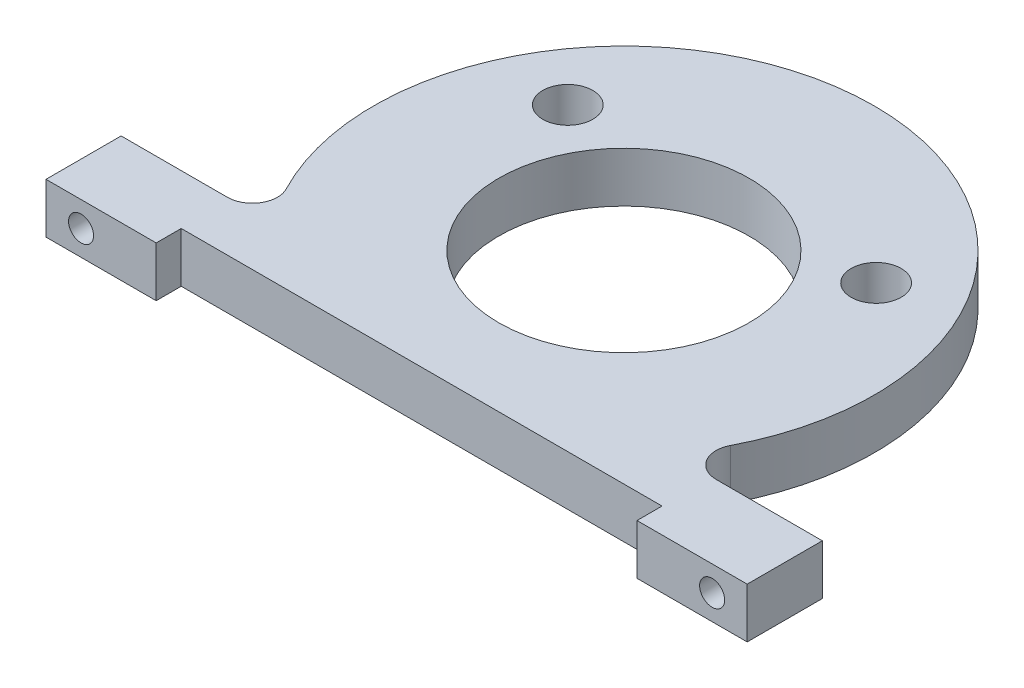
ISO-10303-21;
HEADER;
FILE_DESCRIPTION(('STEP AP214'),'2;1');
FILE_NAME('part.step','',(''),(''),'','','');
FILE_SCHEMA(('AUTOMOTIVE_DESIGN { 1 0 10303 214 1 1 1 1 }'));
ENDSEC;
DATA;
#1=APPLICATION_CONTEXT('core data for automotive mechanical design processes');
#2=APPLICATION_PROTOCOL_DEFINITION('international standard','automotive_design',2000,#1);
#3=PRODUCT_CONTEXT('',#1,'mechanical');
#4=PRODUCT('Part','Part','',(#3));
#5=PRODUCT_RELATED_PRODUCT_CATEGORY('part','',(#4));
#6=PRODUCT_DEFINITION_FORMATION('','',#4);
#7=PRODUCT_DEFINITION_CONTEXT('part definition',#1,'design');
#8=PRODUCT_DEFINITION('design','',#6,#7);
#9=PRODUCT_DEFINITION_SHAPE('','',#8);
#10=(LENGTH_UNIT() NAMED_UNIT(*) SI_UNIT(.MILLI.,.METRE.));
#11=(NAMED_UNIT(*) PLANE_ANGLE_UNIT() SI_UNIT($,.RADIAN.));
#12=(NAMED_UNIT(*) SI_UNIT($,.STERADIAN.) SOLID_ANGLE_UNIT());
#13=UNCERTAINTY_MEASURE_WITH_UNIT(LENGTH_MEASURE(1.E-05),#10,'distance_accuracy_value','');
#14=(GEOMETRIC_REPRESENTATION_CONTEXT(3) GLOBAL_UNCERTAINTY_ASSIGNED_CONTEXT((#13)) GLOBAL_UNIT_ASSIGNED_CONTEXT((#10,
#11,#12)) REPRESENTATION_CONTEXT('',''));
#15=CARTESIAN_POINT('',(0.,0.,0.));
#16=DIRECTION('',(0.,0.,1.));
#17=DIRECTION('',(1.,0.,0.));
#18=AXIS2_PLACEMENT_3D('',#15,#16,#17);
#19=CARTESIAN_POINT('',(0.,10.,0.));
#20=DIRECTION('',(0.,1.,0.));
#21=DIRECTION('',(0.,0.,1.));
#22=AXIS2_PLACEMENT_3D('',#19,#20,#21);
#23=PLANE('',#22);
#24=CARTESIAN_POINT('',(-30.7817352110637,10.,-19.5726233778701));
#25=DIRECTION('',(0.,1.,0.));
#26=DIRECTION('',(0.,0.,1.));
#27=AXIS2_PLACEMENT_3D('',#24,#25,#26);
#28=CIRCLE('',#27,5.);
#29=CARTESIAN_POINT('',(-30.7817352110637,10.,-14.5726233778701));
#30=VERTEX_POINT('',#29);
#31=EDGE_CURVE('E328',#30,#30,#28,.T.);
#32=ORIENTED_EDGE('',*,*,#31,.F.);
#33=EDGE_LOOP('',(#32));
#34=FACE_BOUND('',#33,.T.);
#35=DIRECTION('',(-1.,0.,0.));
#36=VECTOR('',#35,1.);
#37=CARTESIAN_POINT('',(39.7063419814817,10.,30.3876028414487));
#38=LINE('',#37,#36);
#39=CARTESIAN_POINT('',(70.,10.,30.3876028414487));
#40=VERTEX_POINT('',#39);
#41=CARTESIAN_POINT('',(48.7900565890722,10.,30.3876028414487));
#42=VERTEX_POINT('',#41);
#43=EDGE_CURVE('E179',#40,#42,#38,.T.);
#44=ORIENTED_EDGE('',*,*,#43,.T.);
#45=CARTESIAN_POINT('',(48.7900565890722,10.,25.3876028414487));
#46=DIRECTION('',(0.,1.,0.));
#47=DIRECTION('',(0.,0.,1.));
#48=AXIS2_PLACEMENT_3D('',#45,#46,#47);
#49=CIRCLE('',#48,5.);
#50=CARTESIAN_POINT('',(44.3545968991565,10.,23.0796389467716));
#51=VERTEX_POINT('',#50);
#52=EDGE_CURVE('E248',#42,#51,#49,.F.);
#53=ORIENTED_EDGE('',*,*,#52,.T.);
#54=CARTESIAN_POINT('',(0.,10.,0.));
#55=DIRECTION('',(0.,1.,0.));
#56=DIRECTION('',(0.,0.,1.));
#57=AXIS2_PLACEMENT_3D('',#54,#55,#56);
#58=CIRCLE('',#57,50.);
#59=CARTESIAN_POINT('',(-44.3545968991565,10.,23.0796389467716));
#60=VERTEX_POINT('',#59);
#61=EDGE_CURVE('E141',#51,#60,#58,.T.);
#62=ORIENTED_EDGE('',*,*,#61,.T.);
#63=CARTESIAN_POINT('',(-48.7900565890722,10.,25.3876028414487));
#64=DIRECTION('',(0.,1.,0.));
#65=DIRECTION('',(0.,0.,1.));
#66=AXIS2_PLACEMENT_3D('',#63,#64,#65);
#67=CIRCLE('',#66,5.);
#68=CARTESIAN_POINT('',(-48.7900565890722,10.,30.3876028414487));
#69=VERTEX_POINT('',#68);
#70=EDGE_CURVE('E11',#60,#69,#67,.F.);
#71=ORIENTED_EDGE('',*,*,#70,.T.);
#72=DIRECTION('',(-1.,0.,0.));
#73=VECTOR('',#72,1.);
#74=CARTESIAN_POINT('',(-70.,10.,30.3876028414487));
#75=LINE('',#74,#73);
#76=CARTESIAN_POINT('',(-70.,10.,30.3876028414487));
#77=VERTEX_POINT('',#76);
#78=EDGE_CURVE('E129',#69,#77,#75,.T.);
#79=ORIENTED_EDGE('',*,*,#78,.T.);
#80=DIRECTION('',(0.,0.,1.));
#81=VECTOR('',#80,1.);
#82=CARTESIAN_POINT('',(-70.,10.,30.3876028414487));
#83=LINE('',#82,#81);
#84=CARTESIAN_POINT('',(-70.,10.,45.3876028414487));
#85=VERTEX_POINT('',#84);
#86=EDGE_CURVE('E134',#77,#85,#83,.T.);
#87=ORIENTED_EDGE('',*,*,#86,.T.);
#88=DIRECTION('',(1.,0.,0.));
#89=VECTOR('',#88,1.);
#90=CARTESIAN_POINT('',(-70.,10.,45.3876028414487));
#91=LINE('',#90,#89);
#92=CARTESIAN_POINT('',(-48.,10.,45.3876028414487));
#93=VERTEX_POINT('',#92);
#94=EDGE_CURVE('E157',#85,#93,#91,.T.);
#95=ORIENTED_EDGE('',*,*,#94,.T.);
#96=DIRECTION('',(0.,0.,-1.));
#97=VECTOR('',#96,1.);
#98=CARTESIAN_POINT('',(-48.,10.,45.3876028414487));
#99=LINE('',#98,#97);
#100=CARTESIAN_POINT('',(-48.,10.,40.3876028414487));
#101=VERTEX_POINT('',#100);
#102=EDGE_CURVE('E161',#93,#101,#99,.T.);
#103=ORIENTED_EDGE('',*,*,#102,.T.);
#104=DIRECTION('',(1.,0.,0.));
#105=VECTOR('',#104,1.);
#106=CARTESIAN_POINT('',(-48.,10.,40.3876028414487));
#107=LINE('',#106,#105);
#108=CARTESIAN_POINT('',(48.,10.,40.3876028414487));
#109=VERTEX_POINT('',#108);
#110=EDGE_CURVE('E167',#101,#109,#107,.T.);
#111=ORIENTED_EDGE('',*,*,#110,.T.);
#112=DIRECTION('',(0.,0.,1.));
#113=VECTOR('',#112,1.);
#114=CARTESIAN_POINT('',(48.,10.,40.3876028414487));
#115=LINE('',#114,#113);
#116=CARTESIAN_POINT('',(48.,10.,45.3876028414487));
#117=VERTEX_POINT('',#116);
#118=EDGE_CURVE('E170',#109,#117,#115,.T.);
#119=ORIENTED_EDGE('',*,*,#118,.T.);
#120=DIRECTION('',(1.,0.,0.));
#121=VECTOR('',#120,1.);
#122=CARTESIAN_POINT('',(70.,10.,45.3876028414487));
#123=LINE('',#122,#121);
#124=CARTESIAN_POINT('',(70.,10.,45.3876028414487));
#125=VERTEX_POINT('',#124);
#126=EDGE_CURVE('E173',#117,#125,#123,.T.);
#127=ORIENTED_EDGE('',*,*,#126,.T.);
#128=DIRECTION('',(0.,0.,-1.));
#129=VECTOR('',#128,1.);
#130=CARTESIAN_POINT('',(70.,10.,30.3876028414487));
#131=LINE('',#130,#129);
#132=EDGE_CURVE('E176',#125,#40,#131,.T.);
#133=ORIENTED_EDGE('',*,*,#132,.T.);
#134=EDGE_LOOP('',(#44,#53,#62,#71,#79,#87,#95,#103,#111,#119,#127,#133));
#135=FACE_BOUND('',#134,.T.);
#136=CARTESIAN_POINT('',(0.,10.,0.));
#137=DIRECTION('',(0.,1.,0.));
#138=DIRECTION('',(0.,0.,1.));
#139=AXIS2_PLACEMENT_3D('',#136,#137,#138);
#140=CIRCLE('',#139,25.000012525076);
#141=CARTESIAN_POINT('',(0.,10.,25.000012525076));
#142=VERTEX_POINT('',#141);
#143=EDGE_CURVE('E186',#142,#142,#140,.T.);
#144=ORIENTED_EDGE('',*,*,#143,.F.);
#145=EDGE_LOOP('',(#144));
#146=FACE_BOUND('',#145,.T.);
#147=CARTESIAN_POINT('',(30.7817352110637,10.,-19.5726233778701));
#148=DIRECTION('',(0.,1.,0.));
#149=DIRECTION('',(0.,0.,1.));
#150=AXIS2_PLACEMENT_3D('',#147,#148,#149);
#151=CIRCLE('',#150,5.);
#152=CARTESIAN_POINT('',(30.7817352110637,10.,-14.5726233778701));
#153=VERTEX_POINT('',#152);
#154=EDGE_CURVE('E336',#153,#153,#151,.T.);
#155=ORIENTED_EDGE('',*,*,#154,.F.);
#156=EDGE_LOOP('',(#155));
#157=FACE_BOUND('',#156,.T.);
#158=ADVANCED_FACE('F40',(#34,#135,#146,#157),#23,.T.);
#159=CARTESIAN_POINT('',(0.,0.,0.));
#160=DIRECTION('',(0.,1.,0.));
#161=DIRECTION('',(0.,0.,1.));
#162=AXIS2_PLACEMENT_3D('',#159,#160,#161);
#163=PLANE('',#162);
#164=CARTESIAN_POINT('',(0.,0.,0.));
#165=DIRECTION('',(0.,1.,0.));
#166=DIRECTION('',(0.,0.,1.));
#167=AXIS2_PLACEMENT_3D('',#164,#165,#166);
#168=CIRCLE('',#167,50.);
#169=CARTESIAN_POINT('',(44.3545968991565,0.,23.0796389467716));
#170=VERTEX_POINT('',#169);
#171=CARTESIAN_POINT('',(-44.3545968991565,0.,23.0796389467716));
#172=VERTEX_POINT('',#171);
#173=EDGE_CURVE('E183',#170,#172,#168,.T.);
#174=ORIENTED_EDGE('',*,*,#173,.F.);
#175=CARTESIAN_POINT('',(48.7900565890722,0.,25.3876028414487));
#176=DIRECTION('',(0.,1.,0.));
#177=DIRECTION('',(0.,0.,1.));
#178=AXIS2_PLACEMENT_3D('',#175,#176,#177);
#179=CIRCLE('',#178,5.);
#180=CARTESIAN_POINT('',(48.7900565890722,0.,30.3876028414487));
#181=VERTEX_POINT('',#180);
#182=EDGE_CURVE('E245',#170,#181,#179,.T.);
#183=ORIENTED_EDGE('',*,*,#182,.T.);
#184=DIRECTION('',(-1.,0.,0.));
#185=VECTOR('',#184,1.);
#186=CARTESIAN_POINT('',(39.7063419814817,0.,30.3876028414487));
#187=LINE('',#186,#185);
#188=CARTESIAN_POINT('',(70.,0.,30.3876028414487));
#189=VERTEX_POINT('',#188);
#190=EDGE_CURVE('E210',#189,#181,#187,.T.);
#191=ORIENTED_EDGE('',*,*,#190,.F.);
#192=DIRECTION('',(0.,0.,-1.));
#193=VECTOR('',#192,1.);
#194=CARTESIAN_POINT('',(70.,0.,30.3876028414487));
#195=LINE('',#194,#193);
#196=CARTESIAN_POINT('',(70.,0.,45.3876028414487));
#197=VERTEX_POINT('',#196);
#198=EDGE_CURVE('E207',#197,#189,#195,.T.);
#199=ORIENTED_EDGE('',*,*,#198,.F.);
#200=DIRECTION('',(1.,0.,0.));
#201=VECTOR('',#200,1.);
#202=CARTESIAN_POINT('',(70.,0.,45.3876028414487));
#203=LINE('',#202,#201);
#204=CARTESIAN_POINT('',(48.,0.,45.3876028414487));
#205=VERTEX_POINT('',#204);
#206=EDGE_CURVE('E204',#205,#197,#203,.T.);
#207=ORIENTED_EDGE('',*,*,#206,.F.);
#208=DIRECTION('',(0.,0.,1.));
#209=VECTOR('',#208,1.);
#210=CARTESIAN_POINT('',(48.,0.,40.3876028414487));
#211=LINE('',#210,#209);
#212=CARTESIAN_POINT('',(48.,0.,40.3876028414487));
#213=VERTEX_POINT('',#212);
#214=EDGE_CURVE('E201',#213,#205,#211,.T.);
#215=ORIENTED_EDGE('',*,*,#214,.F.);
#216=DIRECTION('',(1.,0.,0.));
#217=VECTOR('',#216,1.);
#218=CARTESIAN_POINT('',(-48.,0.,40.3876028414487));
#219=LINE('',#218,#217);
#220=CARTESIAN_POINT('',(-48.,0.,40.3876028414487));
#221=VERTEX_POINT('',#220);
#222=EDGE_CURVE('E198',#221,#213,#219,.T.);
#223=ORIENTED_EDGE('',*,*,#222,.F.);
#224=DIRECTION('',(0.,0.,-1.));
#225=VECTOR('',#224,1.);
#226=CARTESIAN_POINT('',(-48.,0.,45.3876028414487));
#227=LINE('',#226,#225);
#228=CARTESIAN_POINT('',(-48.,0.,45.3876028414487));
#229=VERTEX_POINT('',#228);
#230=EDGE_CURVE('E195',#229,#221,#227,.T.);
#231=ORIENTED_EDGE('',*,*,#230,.F.);
#232=DIRECTION('',(1.,0.,0.));
#233=VECTOR('',#232,1.);
#234=CARTESIAN_POINT('',(-70.,0.,45.3876028414487));
#235=LINE('',#234,#233);
#236=CARTESIAN_POINT('',(-70.,0.,45.3876028414487));
#237=VERTEX_POINT('',#236);
#238=EDGE_CURVE('E192',#237,#229,#235,.T.);
#239=ORIENTED_EDGE('',*,*,#238,.F.);
#240=DIRECTION('',(0.,0.,1.));
#241=VECTOR('',#240,1.);
#242=CARTESIAN_POINT('',(-70.,0.,30.3876028414487));
#243=LINE('',#242,#241);
#244=CARTESIAN_POINT('',(-70.,0.,30.3876028414487));
#245=VERTEX_POINT('',#244);
#246=EDGE_CURVE('E189',#245,#237,#243,.T.);
#247=ORIENTED_EDGE('',*,*,#246,.F.);
#248=DIRECTION('',(-1.,0.,0.));
#249=VECTOR('',#248,1.);
#250=CARTESIAN_POINT('',(-70.,0.,30.3876028414487));
#251=LINE('',#250,#249);
#252=CARTESIAN_POINT('',(-48.7900565890722,0.,30.3876028414487));
#253=VERTEX_POINT('',#252);
#254=EDGE_CURVE('E146',#253,#245,#251,.T.);
#255=ORIENTED_EDGE('',*,*,#254,.F.);
#256=CARTESIAN_POINT('',(-48.7900565890722,0.,25.3876028414487));
#257=DIRECTION('',(0.,1.,0.));
#258=DIRECTION('',(0.,0.,1.));
#259=AXIS2_PLACEMENT_3D('',#256,#257,#258);
#260=CIRCLE('',#259,5.);
#261=EDGE_CURVE('E49',#253,#172,#260,.T.);
#262=ORIENTED_EDGE('',*,*,#261,.T.);
#263=EDGE_LOOP('',(#174,#183,#191,#199,#207,#215,#223,#231,#239,#247,#255,#262));
#264=FACE_BOUND('',#263,.T.);
#265=CARTESIAN_POINT('',(0.,0.,0.));
#266=DIRECTION('',(0.,1.,0.));
#267=DIRECTION('',(0.,0.,1.));
#268=AXIS2_PLACEMENT_3D('',#265,#266,#267);
#269=CIRCLE('',#268,25.000012525076);
#270=CARTESIAN_POINT('',(0.,0.,25.000012525076));
#271=VERTEX_POINT('',#270);
#272=EDGE_CURVE('E324',#271,#271,#269,.T.);
#273=ORIENTED_EDGE('',*,*,#272,.T.);
#274=EDGE_LOOP('',(#273));
#275=FACE_BOUND('',#274,.T.);
#276=CARTESIAN_POINT('',(-30.7817352110637,0.,-19.5726233778701));
#277=DIRECTION('',(0.,1.,0.));
#278=DIRECTION('',(0.,0.,1.));
#279=AXIS2_PLACEMENT_3D('',#276,#277,#278);
#280=CIRCLE('',#279,5.);
#281=CARTESIAN_POINT('',(-30.7817352110637,0.,-14.5726233778701));
#282=VERTEX_POINT('',#281);
#283=EDGE_CURVE('E332',#282,#282,#280,.T.);
#284=ORIENTED_EDGE('',*,*,#283,.T.);
#285=EDGE_LOOP('',(#284));
#286=FACE_BOUND('',#285,.T.);
#287=CARTESIAN_POINT('',(30.7817352110637,0.,-19.5726233778701));
#288=DIRECTION('',(0.,1.,0.));
#289=DIRECTION('',(0.,0.,1.));
#290=AXIS2_PLACEMENT_3D('',#287,#288,#289);
#291=CIRCLE('',#290,5.);
#292=CARTESIAN_POINT('',(30.7817352110637,0.,-14.5726233778701));
#293=VERTEX_POINT('',#292);
#294=EDGE_CURVE('E340',#293,#293,#291,.T.);
#295=ORIENTED_EDGE('',*,*,#294,.T.);
#296=EDGE_LOOP('',(#295));
#297=FACE_BOUND('',#296,.T.);
#298=ADVANCED_FACE('F280',(#264,#275,#286,#297),#163,.F.);
#299=CARTESIAN_POINT('',(0.,10.,0.));
#300=DIRECTION('',(0.,-1.,0.));
#301=DIRECTION('',(0.,0.,-1.));
#302=AXIS2_PLACEMENT_3D('',#299,#300,#301);
#303=CYLINDRICAL_SURFACE('',#302,50.);
#304=ORIENTED_EDGE('',*,*,#173,.T.);
#305=DIRECTION('',(0.,-1.,0.));
#306=VECTOR('',#305,1.);
#307=CARTESIAN_POINT('',(-44.3545968991565,10.,23.0796389467716));
#308=LINE('',#307,#306);
#309=EDGE_CURVE('E62',#172,#60,#308,.F.);
#310=ORIENTED_EDGE('',*,*,#309,.T.);
#311=ORIENTED_EDGE('',*,*,#61,.F.);
#312=DIRECTION('',(0.,-1.,0.));
#313=VECTOR('',#312,1.);
#314=CARTESIAN_POINT('',(44.3545968991565,10.,23.0796389467716));
#315=LINE('',#314,#313);
#316=EDGE_CURVE('E150',#51,#170,#315,.T.);
#317=ORIENTED_EDGE('',*,*,#316,.T.);
#318=EDGE_LOOP('',(#304,#310,#311,#317));
#319=FACE_BOUND('',#318,.T.);
#320=ADVANCED_FACE('F320',(#319),#303,.T.);
#321=CARTESIAN_POINT('',(-70.,10.,30.3876028414487));
#322=DIRECTION('',(0.,0.,1.));
#323=DIRECTION('',(1.,0.,0.));
#324=AXIS2_PLACEMENT_3D('',#321,#322,#323);
#325=PLANE('',#324);
#326=CARTESIAN_POINT('',(-63.,5.,30.3876028414487));
#327=DIRECTION('',(0.,0.,-1.));
#328=DIRECTION('',(-1.,0.,0.));
#329=AXIS2_PLACEMENT_3D('',#326,#327,#328);
#330=CIRCLE('',#329,2.5);
#331=CARTESIAN_POINT('',(-65.5,5.,30.3876028414487));
#332=VERTEX_POINT('',#331);
#333=EDGE_CURVE('E356',#332,#332,#330,.T.);
#334=ORIENTED_EDGE('',*,*,#333,.F.);
#335=EDGE_LOOP('',(#334));
#336=FACE_BOUND('',#335,.T.);
#337=ORIENTED_EDGE('',*,*,#78,.F.);
#338=DIRECTION('',(0.,1.,0.));
#339=VECTOR('',#338,1.);
#340=CARTESIAN_POINT('',(-48.7900565890722,0.,30.3876028414487));
#341=LINE('',#340,#339);
#342=EDGE_CURVE('E251',#69,#253,#341,.F.);
#343=ORIENTED_EDGE('',*,*,#342,.T.);
#344=ORIENTED_EDGE('',*,*,#254,.T.);
#345=DIRECTION('',(0.,-1.,0.));
#346=VECTOR('',#345,1.);
#347=CARTESIAN_POINT('',(-70.,10.,30.3876028414487));
#348=LINE('',#347,#346);
#349=EDGE_CURVE('E144',#77,#245,#348,.T.);
#350=ORIENTED_EDGE('',*,*,#349,.F.);
#351=EDGE_LOOP('',(#337,#343,#344,#350));
#352=FACE_BOUND('',#351,.T.);
#353=ADVANCED_FACE('F145',(#336,#352),#325,.F.);
#354=CARTESIAN_POINT('',(-70.,10.,30.3876028414487));
#355=DIRECTION('',(1.,0.,0.));
#356=DIRECTION('',(0.,0.,-1.));
#357=AXIS2_PLACEMENT_3D('',#354,#355,#356);
#358=PLANE('',#357);
#359=ORIENTED_EDGE('',*,*,#246,.T.);
#360=DIRECTION('',(0.,-1.,0.));
#361=VECTOR('',#360,1.);
#362=CARTESIAN_POINT('',(-70.,10.,45.3876028414487));
#363=LINE('',#362,#361);
#364=EDGE_CURVE('E151',#85,#237,#363,.T.);
#365=ORIENTED_EDGE('',*,*,#364,.F.);
#366=ORIENTED_EDGE('',*,*,#86,.F.);
#367=ORIENTED_EDGE('',*,*,#349,.T.);
#368=EDGE_LOOP('',(#359,#365,#366,#367));
#369=FACE_BOUND('',#368,.T.);
#370=ADVANCED_FACE('F153',(#369),#358,.F.);
#371=CARTESIAN_POINT('',(-70.,10.,45.3876028414487));
#372=DIRECTION('',(0.,0.,-1.));
#373=DIRECTION('',(-1.,0.,0.));
#374=AXIS2_PLACEMENT_3D('',#371,#372,#373);
#375=PLANE('',#374);
#376=CARTESIAN_POINT('',(-63.,5.,45.3876028414487));
#377=DIRECTION('',(0.,0.,-1.));
#378=DIRECTION('',(-1.,0.,0.));
#379=AXIS2_PLACEMENT_3D('',#376,#377,#378);
#380=CIRCLE('',#379,2.5);
#381=CARTESIAN_POINT('',(-65.5,5.,45.3876028414487));
#382=VERTEX_POINT('',#381);
#383=EDGE_CURVE('E352',#382,#382,#380,.T.);
#384=ORIENTED_EDGE('',*,*,#383,.T.);
#385=EDGE_LOOP('',(#384));
#386=FACE_BOUND('',#385,.T.);
#387=ORIENTED_EDGE('',*,*,#238,.T.);
#388=DIRECTION('',(0.,-1.,0.));
#389=VECTOR('',#388,1.);
#390=CARTESIAN_POINT('',(-48.,10.,45.3876028414487));
#391=LINE('',#390,#389);
#392=EDGE_CURVE('E233',#93,#229,#391,.T.);
#393=ORIENTED_EDGE('',*,*,#392,.F.);
#394=ORIENTED_EDGE('',*,*,#94,.F.);
#395=ORIENTED_EDGE('',*,*,#364,.T.);
#396=EDGE_LOOP('',(#387,#393,#394,#395));
#397=FACE_BOUND('',#396,.T.);
#398=ADVANCED_FACE('F285',(#386,#397),#375,.F.);
#399=CARTESIAN_POINT('',(-48.,10.,45.3876028414487));
#400=DIRECTION('',(-1.,0.,0.));
#401=DIRECTION('',(0.,0.,1.));
#402=AXIS2_PLACEMENT_3D('',#399,#400,#401);
#403=PLANE('',#402);
#404=ORIENTED_EDGE('',*,*,#230,.T.);
#405=DIRECTION('',(0.,-1.,0.));
#406=VECTOR('',#405,1.);
#407=CARTESIAN_POINT('',(-48.,10.,40.3876028414487));
#408=LINE('',#407,#406);
#409=EDGE_CURVE('E229',#101,#221,#408,.T.);
#410=ORIENTED_EDGE('',*,*,#409,.F.);
#411=ORIENTED_EDGE('',*,*,#102,.F.);
#412=ORIENTED_EDGE('',*,*,#392,.T.);
#413=EDGE_LOOP('',(#404,#410,#411,#412));
#414=FACE_BOUND('',#413,.T.);
#415=ADVANCED_FACE('F292',(#414),#403,.F.);
#416=CARTESIAN_POINT('',(-48.,10.,40.3876028414487));
#417=DIRECTION('',(0.,0.,-1.));
#418=DIRECTION('',(-1.,0.,0.));
#419=AXIS2_PLACEMENT_3D('',#416,#417,#418);
#420=PLANE('',#419);
#421=ORIENTED_EDGE('',*,*,#222,.T.);
#422=DIRECTION('',(0.,-1.,0.));
#423=VECTOR('',#422,1.);
#424=CARTESIAN_POINT('',(48.,10.,40.3876028414487));
#425=LINE('',#424,#423);
#426=EDGE_CURVE('E225',#109,#213,#425,.T.);
#427=ORIENTED_EDGE('',*,*,#426,.F.);
#428=ORIENTED_EDGE('',*,*,#110,.F.);
#429=ORIENTED_EDGE('',*,*,#409,.T.);
#430=EDGE_LOOP('',(#421,#427,#428,#429));
#431=FACE_BOUND('',#430,.T.);
#432=ADVANCED_FACE('F295',(#431),#420,.F.);
#433=CARTESIAN_POINT('',(48.,10.,40.3876028414487));
#434=DIRECTION('',(1.,0.,0.));
#435=DIRECTION('',(0.,0.,-1.));
#436=AXIS2_PLACEMENT_3D('',#433,#434,#435);
#437=PLANE('',#436);
#438=ORIENTED_EDGE('',*,*,#214,.T.);
#439=DIRECTION('',(0.,-1.,0.));
#440=VECTOR('',#439,1.);
#441=CARTESIAN_POINT('',(48.,10.,45.3876028414487));
#442=LINE('',#441,#440);
#443=EDGE_CURVE('E221',#117,#205,#442,.T.);
#444=ORIENTED_EDGE('',*,*,#443,.F.);
#445=ORIENTED_EDGE('',*,*,#118,.F.);
#446=ORIENTED_EDGE('',*,*,#426,.T.);
#447=EDGE_LOOP('',(#438,#444,#445,#446));
#448=FACE_BOUND('',#447,.T.);
#449=ADVANCED_FACE('F300',(#448),#437,.F.);
#450=CARTESIAN_POINT('',(70.,10.,45.3876028414487));
#451=DIRECTION('',(0.,0.,-1.));
#452=DIRECTION('',(-1.,0.,0.));
#453=AXIS2_PLACEMENT_3D('',#450,#451,#452);
#454=PLANE('',#453);
#455=CARTESIAN_POINT('',(63.,5.,45.3876028414487));
#456=DIRECTION('',(0.,0.,-1.));
#457=DIRECTION('',(-1.,0.,0.));
#458=AXIS2_PLACEMENT_3D('',#455,#456,#457);
#459=CIRCLE('',#458,2.50000000000001);
#460=CARTESIAN_POINT('',(60.5,5.,45.3876028414487));
#461=VERTEX_POINT('',#460);
#462=EDGE_CURVE('E344',#461,#461,#459,.T.);
#463=ORIENTED_EDGE('',*,*,#462,.T.);
#464=EDGE_LOOP('',(#463));
#465=FACE_BOUND('',#464,.T.);
#466=ORIENTED_EDGE('',*,*,#206,.T.);
#467=DIRECTION('',(0.,-1.,0.));
#468=VECTOR('',#467,1.);
#469=CARTESIAN_POINT('',(70.,10.,45.3876028414487));
#470=LINE('',#469,#468);
#471=EDGE_CURVE('E217',#125,#197,#470,.T.);
#472=ORIENTED_EDGE('',*,*,#471,.F.);
#473=ORIENTED_EDGE('',*,*,#126,.F.);
#474=ORIENTED_EDGE('',*,*,#443,.T.);
#475=EDGE_LOOP('',(#466,#472,#473,#474));
#476=FACE_BOUND('',#475,.T.);
#477=ADVANCED_FACE('F306',(#465,#476),#454,.F.);
#478=CARTESIAN_POINT('',(70.,10.,30.3876028414487));
#479=DIRECTION('',(-1.,0.,0.));
#480=DIRECTION('',(0.,0.,1.));
#481=AXIS2_PLACEMENT_3D('',#478,#479,#480);
#482=PLANE('',#481);
#483=ORIENTED_EDGE('',*,*,#198,.T.);
#484=DIRECTION('',(0.,-1.,0.));
#485=VECTOR('',#484,1.);
#486=CARTESIAN_POINT('',(70.,10.,30.3876028414487));
#487=LINE('',#486,#485);
#488=EDGE_CURVE('E182',#40,#189,#487,.T.);
#489=ORIENTED_EDGE('',*,*,#488,.F.);
#490=ORIENTED_EDGE('',*,*,#132,.F.);
#491=ORIENTED_EDGE('',*,*,#471,.T.);
#492=EDGE_LOOP('',(#483,#489,#490,#491));
#493=FACE_BOUND('',#492,.T.);
#494=ADVANCED_FACE('F310',(#493),#482,.F.);
#495=CARTESIAN_POINT('',(39.7063419814817,10.,30.3876028414487));
#496=DIRECTION('',(0.,0.,1.));
#497=DIRECTION('',(1.,0.,0.));
#498=AXIS2_PLACEMENT_3D('',#495,#496,#497);
#499=PLANE('',#498);
#500=CARTESIAN_POINT('',(63.,5.,30.3876028414487));
#501=DIRECTION('',(0.,0.,-1.));
#502=DIRECTION('',(-1.,0.,0.));
#503=AXIS2_PLACEMENT_3D('',#500,#501,#502);
#504=CIRCLE('',#503,2.50000000000001);
#505=CARTESIAN_POINT('',(60.5,5.,30.3876028414487));
#506=VERTEX_POINT('',#505);
#507=EDGE_CURVE('E348',#506,#506,#504,.T.);
#508=ORIENTED_EDGE('',*,*,#507,.F.);
#509=EDGE_LOOP('',(#508));
#510=FACE_BOUND('',#509,.T.);
#511=ORIENTED_EDGE('',*,*,#190,.T.);
#512=DIRECTION('',(0.,1.,0.));
#513=VECTOR('',#512,1.);
#514=CARTESIAN_POINT('',(48.7900565890722,10.,30.3876028414487));
#515=LINE('',#514,#513);
#516=EDGE_CURVE('E242',#181,#42,#515,.T.);
#517=ORIENTED_EDGE('',*,*,#516,.T.);
#518=ORIENTED_EDGE('',*,*,#43,.F.);
#519=ORIENTED_EDGE('',*,*,#488,.T.);
#520=EDGE_LOOP('',(#511,#517,#518,#519));
#521=FACE_BOUND('',#520,.T.);
#522=ADVANCED_FACE('F314',(#510,#521),#499,.F.);
#523=CARTESIAN_POINT('',(0.,10.,0.));
#524=DIRECTION('',(0.,-1.,0.));
#525=DIRECTION('',(0.,0.,-1.));
#526=AXIS2_PLACEMENT_3D('',#523,#524,#525);
#527=CYLINDRICAL_SURFACE('',#526,25.000012525076);
#528=ORIENTED_EDGE('',*,*,#143,.T.);
#529=EDGE_LOOP('',(#528));
#530=FACE_BOUND('',#529,.T.);
#531=ORIENTED_EDGE('',*,*,#272,.F.);
#532=EDGE_LOOP('',(#531));
#533=FACE_BOUND('',#532,.T.);
#534=ADVANCED_FACE('F390',(#530,#533),#527,.F.);
#535=CARTESIAN_POINT('',(-30.7817352110637,10.,-19.5726233778701));
#536=DIRECTION('',(0.,-1.,0.));
#537=DIRECTION('',(0.,0.,-1.));
#538=AXIS2_PLACEMENT_3D('',#535,#536,#537);
#539=CYLINDRICAL_SURFACE('',#538,5.);
#540=ORIENTED_EDGE('',*,*,#31,.T.);
#541=EDGE_LOOP('',(#540));
#542=FACE_BOUND('',#541,.T.);
#543=ORIENTED_EDGE('',*,*,#283,.F.);
#544=EDGE_LOOP('',(#543));
#545=FACE_BOUND('',#544,.T.);
#546=ADVANCED_FACE('F442',(#542,#545),#539,.F.);
#547=CARTESIAN_POINT('',(30.7817352110637,10.,-19.5726233778701));
#548=DIRECTION('',(0.,-1.,0.));
#549=DIRECTION('',(0.,0.,-1.));
#550=AXIS2_PLACEMENT_3D('',#547,#548,#549);
#551=CYLINDRICAL_SURFACE('',#550,5.);
#552=ORIENTED_EDGE('',*,*,#154,.T.);
#553=EDGE_LOOP('',(#552));
#554=FACE_BOUND('',#553,.T.);
#555=ORIENTED_EDGE('',*,*,#294,.F.);
#556=EDGE_LOOP('',(#555));
#557=FACE_BOUND('',#556,.T.);
#558=ADVANCED_FACE('F449',(#554,#557),#551,.F.);
#559=CARTESIAN_POINT('',(63.,5.,45.3876028414487));
#560=DIRECTION('',(0.,0.,-1.));
#561=DIRECTION('',(-1.,0.,0.));
#562=AXIS2_PLACEMENT_3D('',#559,#560,#561);
#563=CYLINDRICAL_SURFACE('',#562,2.50000000000001);
#564=ORIENTED_EDGE('',*,*,#462,.F.);
#565=EDGE_LOOP('',(#564));
#566=FACE_BOUND('',#565,.T.);
#567=ORIENTED_EDGE('',*,*,#507,.T.);
#568=EDGE_LOOP('',(#567));
#569=FACE_BOUND('',#568,.T.);
#570=ADVANCED_FACE('F369',(#566,#569),#563,.F.);
#571=CARTESIAN_POINT('',(-63.,5.,45.3876028414487));
#572=DIRECTION('',(0.,0.,-1.));
#573=DIRECTION('',(-1.,0.,0.));
#574=AXIS2_PLACEMENT_3D('',#571,#572,#573);
#575=CYLINDRICAL_SURFACE('',#574,2.5);
#576=ORIENTED_EDGE('',*,*,#383,.F.);
#577=EDGE_LOOP('',(#576));
#578=FACE_BOUND('',#577,.T.);
#579=ORIENTED_EDGE('',*,*,#333,.T.);
#580=EDGE_LOOP('',(#579));
#581=FACE_BOUND('',#580,.T.);
#582=ADVANCED_FACE('F366',(#578,#581),#575,.F.);
#583=CARTESIAN_POINT('',(48.7900565890722,10.,25.3876028414487));
#584=DIRECTION('',(0.,-1.,0.));
#585=DIRECTION('',(0.,0.,-1.));
#586=AXIS2_PLACEMENT_3D('',#583,#584,#585);
#587=CYLINDRICAL_SURFACE('',#586,5.);
#588=ORIENTED_EDGE('',*,*,#52,.F.);
#589=ORIENTED_EDGE('',*,*,#516,.F.);
#590=ORIENTED_EDGE('',*,*,#182,.F.);
#591=ORIENTED_EDGE('',*,*,#316,.F.);
#592=EDGE_LOOP('',(#588,#589,#590,#591));
#593=FACE_BOUND('',#592,.T.);
#594=ADVANCED_FACE('F319',(#593),#587,.F.);
#595=CARTESIAN_POINT('',(-48.7900565890722,10.,25.3876028414487));
#596=DIRECTION('',(0.,-1.,0.));
#597=DIRECTION('',(0.,0.,-1.));
#598=AXIS2_PLACEMENT_3D('',#595,#596,#597);
#599=CYLINDRICAL_SURFACE('',#598,5.);
#600=ORIENTED_EDGE('',*,*,#70,.F.);
#601=ORIENTED_EDGE('',*,*,#309,.F.);
#602=ORIENTED_EDGE('',*,*,#261,.F.);
#603=ORIENTED_EDGE('',*,*,#342,.F.);
#604=EDGE_LOOP('',(#600,#601,#602,#603));
#605=FACE_BOUND('',#604,.T.);
#606=ADVANCED_FACE('F42',(#605),#599,.F.);
#607=CLOSED_SHELL('',(#158,#298,#320,#353,#370,#398,#415,#432,#449,#477,#494,#522,#534,#546,
#558,#570,#582,#594,#606));
#608=MANIFOLD_SOLID_BREP('B2',#607);
#609=ADVANCED_BREP_SHAPE_REPRESENTATION('',(#18,#608),#14);
#610=SHAPE_DEFINITION_REPRESENTATION(#9,#609);
ENDSEC;
END-ISO-10303-21;
